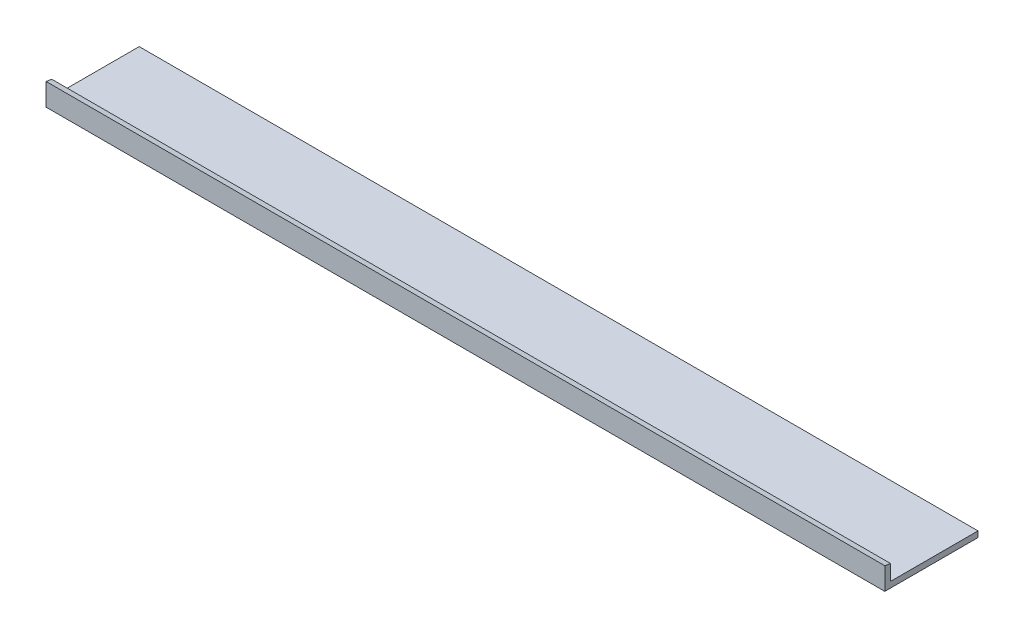
ISO-10303-21;
HEADER;
FILE_DESCRIPTION(('STEP AP214'),'2;1');
FILE_NAME('part.step','',(''),(''),'','','');
FILE_SCHEMA(('AUTOMOTIVE_DESIGN { 1 0 10303 214 1 1 1 1 }'));
ENDSEC;
DATA;
#1=APPLICATION_CONTEXT('core data for automotive mechanical design processes');
#2=APPLICATION_PROTOCOL_DEFINITION('international standard','automotive_design',2000,#1);
#3=PRODUCT_CONTEXT('',#1,'mechanical');
#4=PRODUCT('Part','Part','',(#3));
#5=PRODUCT_RELATED_PRODUCT_CATEGORY('part','',(#4));
#6=PRODUCT_DEFINITION_FORMATION('','',#4);
#7=PRODUCT_DEFINITION_CONTEXT('part definition',#1,'design');
#8=PRODUCT_DEFINITION('design','',#6,#7);
#9=PRODUCT_DEFINITION_SHAPE('','',#8);
#10=(LENGTH_UNIT() NAMED_UNIT(*) SI_UNIT(.MILLI.,.METRE.));
#11=(NAMED_UNIT(*) PLANE_ANGLE_UNIT() SI_UNIT($,.RADIAN.));
#12=(NAMED_UNIT(*) SI_UNIT($,.STERADIAN.) SOLID_ANGLE_UNIT());
#13=UNCERTAINTY_MEASURE_WITH_UNIT(LENGTH_MEASURE(1.E-05),#10,'distance_accuracy_value','');
#14=(GEOMETRIC_REPRESENTATION_CONTEXT(3) GLOBAL_UNCERTAINTY_ASSIGNED_CONTEXT((#13)) GLOBAL_UNIT_ASSIGNED_CONTEXT((#10,
#11,#12)) REPRESENTATION_CONTEXT('',''));
#15=CARTESIAN_POINT('',(0.,0.,0.));
#16=DIRECTION('',(0.,0.,1.));
#17=DIRECTION('',(1.,0.,0.));
#18=AXIS2_PLACEMENT_3D('',#15,#16,#17);
#19=CARTESIAN_POINT('',(457.2,0.,0.));
#20=DIRECTION('',(0.,0.,1.));
#21=DIRECTION('',(1.,0.,0.));
#22=AXIS2_PLACEMENT_3D('',#19,#20,#21);
#23=PLANE('',#22);
#24=DIRECTION('',(0.,1.,0.));
#25=VECTOR('',#24,1.);
#26=CARTESIAN_POINT('',(0.,0.,0.));
#27=LINE('',#26,#25);
#28=CARTESIAN_POINT('',(0.,0.,0.));
#29=VERTEX_POINT('',#28);
#30=CARTESIAN_POINT('',(0.,12.13231,0.));
#31=VERTEX_POINT('',#30);
#32=EDGE_CURVE('E90',#29,#31,#27,.T.);
#33=ORIENTED_EDGE('',*,*,#32,.F.);
#34=DIRECTION('',(-1.,0.,0.));
#35=VECTOR('',#34,1.);
#36=CARTESIAN_POINT('',(457.2,0.,0.));
#37=LINE('',#36,#35);
#38=CARTESIAN_POINT('',(457.2,0.,0.));
#39=VERTEX_POINT('',#38);
#40=EDGE_CURVE('E49',#39,#29,#37,.T.);
#41=ORIENTED_EDGE('',*,*,#40,.F.);
#42=DIRECTION('',(0.,1.,0.));
#43=VECTOR('',#42,1.);
#44=CARTESIAN_POINT('',(457.2,0.,0.));
#45=LINE('',#44,#43);
#46=CARTESIAN_POINT('',(457.2,12.13231,0.));
#47=VERTEX_POINT('',#46);
#48=EDGE_CURVE('E106',#39,#47,#45,.T.);
#49=ORIENTED_EDGE('',*,*,#48,.T.);
#50=DIRECTION('',(-1.,0.,0.));
#51=VECTOR('',#50,1.);
#52=CARTESIAN_POINT('',(457.2,12.13231,0.));
#53=LINE('',#52,#51);
#54=EDGE_CURVE('E11',#47,#31,#53,.T.);
#55=ORIENTED_EDGE('',*,*,#54,.T.);
#56=EDGE_LOOP('',(#33,#41,#49,#55));
#57=FACE_BOUND('',#56,.T.);
#58=ADVANCED_FACE('F39',(#57),#23,.T.);
#59=CARTESIAN_POINT('',(457.2,0.,0.));
#60=DIRECTION('',(0.,1.,0.));
#61=DIRECTION('',(0.,0.,1.));
#62=AXIS2_PLACEMENT_3D('',#59,#60,#61);
#63=PLANE('',#62);
#64=DIRECTION('',(0.,0.,-1.));
#65=VECTOR('',#64,1.);
#66=CARTESIAN_POINT('',(0.,0.,0.));
#67=LINE('',#66,#65);
#68=CARTESIAN_POINT('',(0.,0.,-50.8));
#69=VERTEX_POINT('',#68);
#70=EDGE_CURVE('E79',#29,#69,#67,.T.);
#71=ORIENTED_EDGE('',*,*,#70,.T.);
#72=DIRECTION('',(-1.,0.,0.));
#73=VECTOR('',#72,1.);
#74=CARTESIAN_POINT('',(457.2,0.,-50.8));
#75=LINE('',#74,#73);
#76=CARTESIAN_POINT('',(457.2,0.,-50.8));
#77=VERTEX_POINT('',#76);
#78=EDGE_CURVE('E43',#77,#69,#75,.T.);
#79=ORIENTED_EDGE('',*,*,#78,.F.);
#80=DIRECTION('',(0.,0.,-1.));
#81=VECTOR('',#80,1.);
#82=CARTESIAN_POINT('',(457.2,0.,0.));
#83=LINE('',#82,#81);
#84=EDGE_CURVE('E81',#39,#77,#83,.T.);
#85=ORIENTED_EDGE('',*,*,#84,.F.);
#86=ORIENTED_EDGE('',*,*,#40,.T.);
#87=EDGE_LOOP('',(#71,#79,#85,#86));
#88=FACE_BOUND('',#87,.T.);
#89=ADVANCED_FACE('F77',(#88),#63,.F.);
#90=CARTESIAN_POINT('',(457.2,0.,-50.8));
#91=DIRECTION('',(0.,0.,1.));
#92=DIRECTION('',(1.,0.,0.));
#93=AXIS2_PLACEMENT_3D('',#90,#91,#92);
#94=PLANE('',#93);
#95=DIRECTION('',(0.,1.,0.));
#96=VECTOR('',#95,1.);
#97=CARTESIAN_POINT('',(0.,0.,-50.8));
#98=LINE('',#97,#96);
#99=CARTESIAN_POINT('',(0.,3.175,-50.8));
#100=VERTEX_POINT('',#99);
#101=EDGE_CURVE('E92',#69,#100,#98,.T.);
#102=ORIENTED_EDGE('',*,*,#101,.T.);
#103=DIRECTION('',(-1.,0.,0.));
#104=VECTOR('',#103,1.);
#105=CARTESIAN_POINT('',(457.2,3.175,-50.8));
#106=LINE('',#105,#104);
#107=CARTESIAN_POINT('',(457.2,3.175,-50.8));
#108=VERTEX_POINT('',#107);
#109=EDGE_CURVE('E57',#108,#100,#106,.T.);
#110=ORIENTED_EDGE('',*,*,#109,.F.);
#111=DIRECTION('',(0.,1.,0.));
#112=VECTOR('',#111,1.);
#113=CARTESIAN_POINT('',(457.2,0.,-50.8));
#114=LINE('',#113,#112);
#115=EDGE_CURVE('E97',#77,#108,#114,.T.);
#116=ORIENTED_EDGE('',*,*,#115,.F.);
#117=ORIENTED_EDGE('',*,*,#78,.T.);
#118=EDGE_LOOP('',(#102,#110,#116,#117));
#119=FACE_BOUND('',#118,.T.);
#120=ADVANCED_FACE('F41',(#119),#94,.F.);
#121=CARTESIAN_POINT('',(457.2,0.,0.));
#122=DIRECTION('',(1.,0.,0.));
#123=DIRECTION('',(0.,0.,-1.));
#124=AXIS2_PLACEMENT_3D('',#121,#122,#123);
#125=PLANE('',#124);
#126=DIRECTION('',(0.,0.173648177666924,0.984807753012209));
#127=VECTOR('',#126,1.);
#128=CARTESIAN_POINT('',(457.2,12.13231,0.));
#129=LINE('',#128,#127);
#130=CARTESIAN_POINT('',(457.2,11.5724718362506,-3.175));
#131=VERTEX_POINT('',#130);
#132=EDGE_CURVE('E114',#131,#47,#129,.T.);
#133=ORIENTED_EDGE('',*,*,#132,.T.);
#134=ORIENTED_EDGE('',*,*,#48,.F.);
#135=ORIENTED_EDGE('',*,*,#84,.T.);
#136=ORIENTED_EDGE('',*,*,#115,.T.);
#137=DIRECTION('',(0.,0.,1.));
#138=VECTOR('',#137,1.);
#139=CARTESIAN_POINT('',(457.2,3.175,-41.275));
#140=LINE('',#139,#138);
#141=CARTESIAN_POINT('',(457.2,3.175,-3.175));
#142=VERTEX_POINT('',#141);
#143=EDGE_CURVE('E125',#108,#142,#140,.T.);
#144=ORIENTED_EDGE('',*,*,#143,.T.);
#145=DIRECTION('',(0.,1.,0.));
#146=VECTOR('',#145,1.);
#147=CARTESIAN_POINT('',(457.2,11.5724718362506,-3.175));
#148=LINE('',#147,#146);
#149=EDGE_CURVE('E136',#142,#131,#148,.T.);
#150=ORIENTED_EDGE('',*,*,#149,.T.);
#151=EDGE_LOOP('',(#133,#134,#135,#136,#144,#150));
#152=FACE_BOUND('',#151,.T.);
#153=ADVANCED_FACE('F144',(#152),#125,.T.);
#154=CARTESIAN_POINT('',(0.,0.,0.));
#155=DIRECTION('',(1.,0.,0.));
#156=DIRECTION('',(0.,0.,-1.));
#157=AXIS2_PLACEMENT_3D('',#154,#155,#156);
#158=PLANE('',#157);
#159=ORIENTED_EDGE('',*,*,#32,.T.);
#160=DIRECTION('',(0.,0.173648177666924,0.984807753012209));
#161=VECTOR('',#160,1.);
#162=CARTESIAN_POINT('',(0.,12.13231,0.));
#163=LINE('',#162,#161);
#164=CARTESIAN_POINT('',(0.,11.5724718362506,-3.175));
#165=VERTEX_POINT('',#164);
#166=EDGE_CURVE('E121',#165,#31,#163,.T.);
#167=ORIENTED_EDGE('',*,*,#166,.F.);
#168=DIRECTION('',(0.,1.,0.));
#169=VECTOR('',#168,1.);
#170=CARTESIAN_POINT('',(0.,11.5724718362506,-3.175));
#171=LINE('',#170,#169);
#172=CARTESIAN_POINT('',(0.,3.175,-3.175));
#173=VERTEX_POINT('',#172);
#174=EDGE_CURVE('E126',#173,#165,#171,.T.);
#175=ORIENTED_EDGE('',*,*,#174,.F.);
#176=DIRECTION('',(0.,0.,1.));
#177=VECTOR('',#176,1.);
#178=CARTESIAN_POINT('',(0.,3.175,-41.275));
#179=LINE('',#178,#177);
#180=EDGE_CURVE('E130',#100,#173,#179,.T.);
#181=ORIENTED_EDGE('',*,*,#180,.F.);
#182=ORIENTED_EDGE('',*,*,#101,.F.);
#183=ORIENTED_EDGE('',*,*,#70,.F.);
#184=EDGE_LOOP('',(#159,#167,#175,#181,#182,#183));
#185=FACE_BOUND('',#184,.T.);
#186=ADVANCED_FACE('F87',(#185),#158,.F.);
#187=CARTESIAN_POINT('',(457.2,12.13231,0.));
#188=DIRECTION('',(0.,-0.984807753012209,0.173648177666924));
#189=DIRECTION('',(0.,-0.173648177666924,-0.984807753012209));
#190=AXIS2_PLACEMENT_3D('',#187,#188,#189);
#191=PLANE('',#190);
#192=ORIENTED_EDGE('',*,*,#166,.T.);
#193=ORIENTED_EDGE('',*,*,#54,.F.);
#194=ORIENTED_EDGE('',*,*,#132,.F.);
#195=DIRECTION('',(-1.,0.,0.));
#196=VECTOR('',#195,1.);
#197=CARTESIAN_POINT('',(457.2,11.5724718362506,-3.175));
#198=LINE('',#197,#196);
#199=EDGE_CURVE('E105',#131,#165,#198,.T.);
#200=ORIENTED_EDGE('',*,*,#199,.T.);
#201=EDGE_LOOP('',(#192,#193,#194,#200));
#202=FACE_BOUND('',#201,.T.);
#203=ADVANCED_FACE('F167',(#202),#191,.F.);
#204=CARTESIAN_POINT('',(457.2,11.5724718362506,-3.175));
#205=DIRECTION('',(0.,0.,1.));
#206=DIRECTION('',(0.,-1.,0.));
#207=AXIS2_PLACEMENT_3D('',#204,#205,#206);
#208=PLANE('',#207);
#209=ORIENTED_EDGE('',*,*,#174,.T.);
#210=ORIENTED_EDGE('',*,*,#199,.F.);
#211=ORIENTED_EDGE('',*,*,#149,.F.);
#212=DIRECTION('',(-1.,0.,0.));
#213=VECTOR('',#212,1.);
#214=CARTESIAN_POINT('',(457.2,3.175,-3.175));
#215=LINE('',#214,#213);
#216=EDGE_CURVE('E113',#142,#173,#215,.T.);
#217=ORIENTED_EDGE('',*,*,#216,.T.);
#218=EDGE_LOOP('',(#209,#210,#211,#217));
#219=FACE_BOUND('',#218,.T.);
#220=ADVANCED_FACE('F171',(#219),#208,.F.);
#221=CARTESIAN_POINT('',(457.2,3.175,-41.275));
#222=DIRECTION('',(0.,-1.,0.));
#223=DIRECTION('',(0.,0.,-1.));
#224=AXIS2_PLACEMENT_3D('',#221,#222,#223);
#225=PLANE('',#224);
#226=ORIENTED_EDGE('',*,*,#180,.T.);
#227=ORIENTED_EDGE('',*,*,#216,.F.);
#228=ORIENTED_EDGE('',*,*,#143,.F.);
#229=ORIENTED_EDGE('',*,*,#109,.T.);
#230=EDGE_LOOP('',(#226,#227,#228,#229));
#231=FACE_BOUND('',#230,.T.);
#232=ADVANCED_FACE('F151',(#231),#225,.F.);
#233=CLOSED_SHELL('',(#58,#89,#120,#153,#186,#203,#220,#232));
#234=MANIFOLD_SOLID_BREP('B2',#233);
#235=ADVANCED_BREP_SHAPE_REPRESENTATION('',(#18,#234),#14);
#236=SHAPE_DEFINITION_REPRESENTATION(#9,#235);
ENDSEC;
END-ISO-10303-21;
